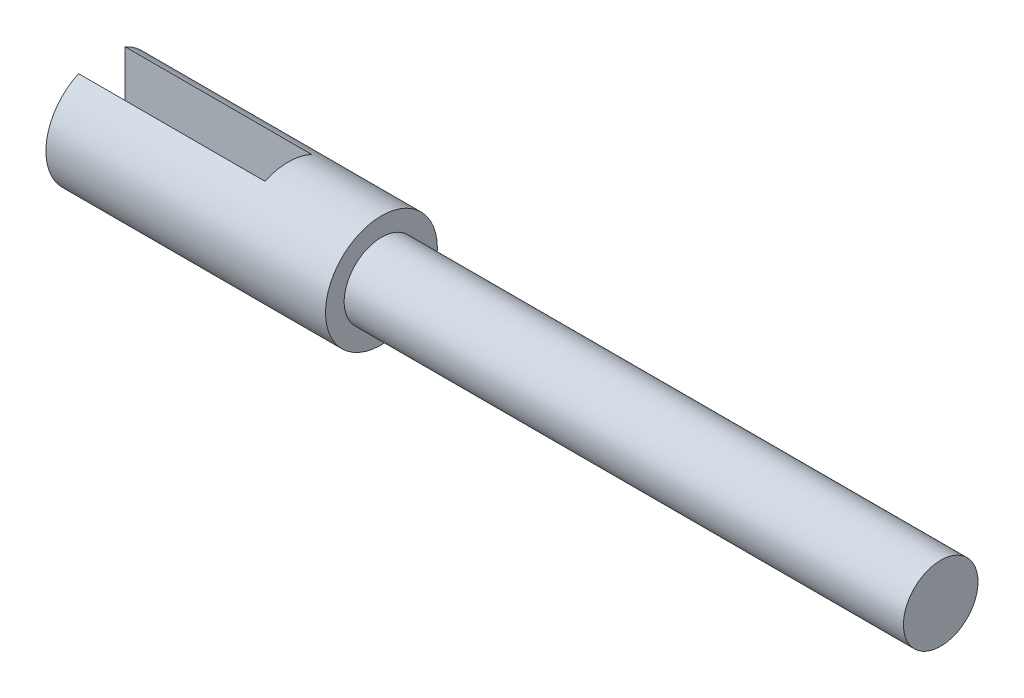
ISO-10303-21;
HEADER;
FILE_DESCRIPTION(('STEP AP214'),'2;1');
FILE_NAME('part.step','',(''),(''),'','','');
FILE_SCHEMA(('AUTOMOTIVE_DESIGN { 1 0 10303 214 1 1 1 1 }'));
ENDSEC;
DATA;
#1=APPLICATION_CONTEXT('core data for automotive mechanical design processes');
#2=APPLICATION_PROTOCOL_DEFINITION('international standard','automotive_design',2000,#1);
#3=PRODUCT_CONTEXT('',#1,'mechanical');
#4=PRODUCT('Part','Part','',(#3));
#5=PRODUCT_RELATED_PRODUCT_CATEGORY('part','',(#4));
#6=PRODUCT_DEFINITION_FORMATION('','',#4);
#7=PRODUCT_DEFINITION_CONTEXT('part definition',#1,'design');
#8=PRODUCT_DEFINITION('design','',#6,#7);
#9=PRODUCT_DEFINITION_SHAPE('','',#8);
#10=(LENGTH_UNIT() NAMED_UNIT(*) SI_UNIT(.MILLI.,.METRE.));
#11=(NAMED_UNIT(*) PLANE_ANGLE_UNIT() SI_UNIT($,.RADIAN.));
#12=(NAMED_UNIT(*) SI_UNIT($,.STERADIAN.) SOLID_ANGLE_UNIT());
#13=UNCERTAINTY_MEASURE_WITH_UNIT(LENGTH_MEASURE(1.E-05),#10,'distance_accuracy_value','');
#14=(GEOMETRIC_REPRESENTATION_CONTEXT(3) GLOBAL_UNCERTAINTY_ASSIGNED_CONTEXT((#13)) GLOBAL_UNIT_ASSIGNED_CONTEXT((#10,
#11,#12)) REPRESENTATION_CONTEXT('',''));
#15=CARTESIAN_POINT('',(0.,0.,0.));
#16=DIRECTION('',(0.,0.,1.));
#17=DIRECTION('',(1.,0.,0.));
#18=AXIS2_PLACEMENT_3D('',#15,#16,#17);
#19=CARTESIAN_POINT('',(-19.05,0.,0.));
#20=DIRECTION('',(1.,0.,0.));
#21=DIRECTION('',(0.,0.,-1.));
#22=AXIS2_PLACEMENT_3D('',#19,#20,#21);
#23=PLANE('',#22);
#24=CARTESIAN_POINT('',(-19.05,0.,0.));
#25=DIRECTION('',(1.,0.,0.));
#26=DIRECTION('',(0.,0.,-1.));
#27=AXIS2_PLACEMENT_3D('',#24,#25,#26);
#28=CIRCLE('',#27,3.81);
#29=CARTESIAN_POINT('',(-19.05,-3.46351609639684,-1.5875));
#30=VERTEX_POINT('',#29);
#31=CARTESIAN_POINT('',(-19.05,3.46351609639684,-1.5875));
#32=VERTEX_POINT('',#31);
#33=EDGE_CURVE('E94',#30,#32,#28,.T.);
#34=ORIENTED_EDGE('',*,*,#33,.F.);
#35=DIRECTION('',(0.,1.,0.));
#36=VECTOR('',#35,1.);
#37=CARTESIAN_POINT('',(-19.05,0.,-1.5875));
#38=LINE('',#37,#36);
#39=EDGE_CURVE('E106',#30,#32,#38,.T.);
#40=ORIENTED_EDGE('',*,*,#39,.T.);
#41=EDGE_LOOP('',(#34,#40));
#42=FACE_BOUND('',#41,.T.);
#43=ADVANCED_FACE('F32',(#42),#23,.F.);
#44=CARTESIAN_POINT('',(38.1,0.,0.));
#45=DIRECTION('',(-1.,0.,0.));
#46=DIRECTION('',(0.,0.,1.));
#47=AXIS2_PLACEMENT_3D('',#44,#45,#46);
#48=CYLINDRICAL_SURFACE('',#47,2.54);
#49=CARTESIAN_POINT('',(38.1,0.,0.));
#50=DIRECTION('',(1.,0.,0.));
#51=DIRECTION('',(0.,0.,-1.));
#52=AXIS2_PLACEMENT_3D('',#49,#50,#51);
#53=CIRCLE('',#52,2.54);
#54=CARTESIAN_POINT('',(38.1,0.,-2.54));
#55=VERTEX_POINT('',#54);
#56=EDGE_CURVE('E102',#55,#55,#53,.T.);
#57=ORIENTED_EDGE('',*,*,#56,.F.);
#58=EDGE_LOOP('',(#57));
#59=FACE_BOUND('',#58,.T.);
#60=CARTESIAN_POINT('',(0.,0.,0.));
#61=DIRECTION('',(1.,0.,0.));
#62=DIRECTION('',(0.,0.,-1.));
#63=AXIS2_PLACEMENT_3D('',#60,#61,#62);
#64=CIRCLE('',#63,2.54);
#65=CARTESIAN_POINT('',(0.,0.,-2.54));
#66=VERTEX_POINT('',#65);
#67=EDGE_CURVE('E99',#66,#66,#64,.T.);
#68=ORIENTED_EDGE('',*,*,#67,.T.);
#69=EDGE_LOOP('',(#68));
#70=FACE_BOUND('',#69,.T.);
#71=ADVANCED_FACE('F34',(#59,#70),#48,.T.);
#72=CARTESIAN_POINT('',(38.1,0.,0.));
#73=DIRECTION('',(1.,0.,0.));
#74=DIRECTION('',(0.,0.,-1.));
#75=AXIS2_PLACEMENT_3D('',#72,#73,#74);
#76=PLANE('',#75);
#77=ORIENTED_EDGE('',*,*,#56,.T.);
#78=EDGE_LOOP('',(#77));
#79=FACE_BOUND('',#78,.T.);
#80=ADVANCED_FACE('F130',(#79),#76,.T.);
#81=CARTESIAN_POINT('',(-19.05,0.,0.));
#82=DIRECTION('',(1.,0.,0.));
#83=DIRECTION('',(0.,0.,-1.));
#84=AXIS2_PLACEMENT_3D('',#81,#82,#83);
#85=CYLINDRICAL_SURFACE('',#84,3.81);
#86=DIRECTION('',(1.,0.,0.));
#87=VECTOR('',#86,1.);
#88=CARTESIAN_POINT('',(-19.05,-3.46351609639684,-1.5875));
#89=LINE('',#88,#87);
#90=CARTESIAN_POINT('',(-6.35,-3.46351609639684,-1.5875));
#91=VERTEX_POINT('',#90);
#92=EDGE_CURVE('E86',#30,#91,#89,.T.);
#93=ORIENTED_EDGE('',*,*,#92,.F.);
#94=ORIENTED_EDGE('',*,*,#33,.T.);
#95=DIRECTION('',(1.,0.,0.));
#96=VECTOR('',#95,1.);
#97=CARTESIAN_POINT('',(-19.05,3.46351609639684,-1.5875));
#98=LINE('',#97,#96);
#99=CARTESIAN_POINT('',(-6.35,3.46351609639684,-1.5875));
#100=VERTEX_POINT('',#99);
#101=EDGE_CURVE('E88',#100,#32,#98,.F.);
#102=ORIENTED_EDGE('',*,*,#101,.F.);
#103=CARTESIAN_POINT('',(-6.35,0.,0.));
#104=DIRECTION('',(1.,0.,0.));
#105=DIRECTION('',(0.,0.,-1.));
#106=AXIS2_PLACEMENT_3D('',#103,#104,#105);
#107=CIRCLE('',#106,3.81);
#108=CARTESIAN_POINT('',(-6.35,3.46351609639684,1.5875));
#109=VERTEX_POINT('',#108);
#110=EDGE_CURVE('E36',#109,#100,#107,.F.);
#111=ORIENTED_EDGE('',*,*,#110,.F.);
#112=DIRECTION('',(1.,0.,0.));
#113=VECTOR('',#112,1.);
#114=CARTESIAN_POINT('',(-19.05,3.46351609639684,1.5875));
#115=LINE('',#114,#113);
#116=CARTESIAN_POINT('',(-19.05,3.46351609639684,1.5875));
#117=VERTEX_POINT('',#116);
#118=EDGE_CURVE('E79',#117,#109,#115,.T.);
#119=ORIENTED_EDGE('',*,*,#118,.F.);
#120=CARTESIAN_POINT('',(-19.05,-3.46351609639684,1.5875));
#121=VERTEX_POINT('',#120);
#122=EDGE_CURVE('E85',#117,#121,#28,.T.);
#123=ORIENTED_EDGE('',*,*,#122,.T.);
#124=DIRECTION('',(1.,0.,0.));
#125=VECTOR('',#124,1.);
#126=CARTESIAN_POINT('',(-19.05,-3.46351609639684,1.5875));
#127=LINE('',#126,#125);
#128=CARTESIAN_POINT('',(-6.35,-3.46351609639684,1.5875));
#129=VERTEX_POINT('',#128);
#130=EDGE_CURVE('E47',#129,#121,#127,.F.);
#131=ORIENTED_EDGE('',*,*,#130,.F.);
#132=EDGE_CURVE('E11',#91,#129,#107,.F.);
#133=ORIENTED_EDGE('',*,*,#132,.F.);
#134=EDGE_LOOP('',(#93,#94,#102,#111,#119,#123,#131,#133));
#135=FACE_BOUND('',#134,.T.);
#136=CARTESIAN_POINT('',(0.,0.,0.));
#137=DIRECTION('',(1.,0.,0.));
#138=DIRECTION('',(0.,0.,-1.));
#139=AXIS2_PLACEMENT_3D('',#136,#137,#138);
#140=CIRCLE('',#139,3.81);
#141=CARTESIAN_POINT('',(0.,0.,-3.81));
#142=VERTEX_POINT('',#141);
#143=EDGE_CURVE('E93',#142,#142,#140,.T.);
#144=ORIENTED_EDGE('',*,*,#143,.F.);
#145=EDGE_LOOP('',(#144));
#146=FACE_BOUND('',#145,.T.);
#147=ADVANCED_FACE('F82',(#135,#146),#85,.T.);
#148=ORIENTED_EDGE('',*,*,#122,.F.);
#149=DIRECTION('',(0.,-1.,0.));
#150=VECTOR('',#149,1.);
#151=CARTESIAN_POINT('',(-19.05,0.,1.5875));
#152=LINE('',#151,#150);
#153=EDGE_CURVE('E105',#117,#121,#152,.T.);
#154=ORIENTED_EDGE('',*,*,#153,.T.);
#155=EDGE_LOOP('',(#148,#154));
#156=FACE_BOUND('',#155,.T.);
#157=ADVANCED_FACE('F122',(#156),#23,.F.);
#158=CARTESIAN_POINT('',(0.,0.,0.));
#159=DIRECTION('',(1.,0.,0.));
#160=DIRECTION('',(0.,0.,-1.));
#161=AXIS2_PLACEMENT_3D('',#158,#159,#160);
#162=PLANE('',#161);
#163=ORIENTED_EDGE('',*,*,#67,.F.);
#164=EDGE_LOOP('',(#163));
#165=FACE_BOUND('',#164,.T.);
#166=ORIENTED_EDGE('',*,*,#143,.T.);
#167=EDGE_LOOP('',(#166));
#168=FACE_BOUND('',#167,.T.);
#169=ADVANCED_FACE('F115',(#165,#168),#162,.T.);
#170=CARTESIAN_POINT('',(-19.05,-3.81,-1.5875));
#171=DIRECTION('',(0.,0.,-1.));
#172=DIRECTION('',(-1.,0.,0.));
#173=AXIS2_PLACEMENT_3D('',#170,#171,#172);
#174=PLANE('',#173);
#175=ORIENTED_EDGE('',*,*,#101,.T.);
#176=ORIENTED_EDGE('',*,*,#39,.F.);
#177=ORIENTED_EDGE('',*,*,#92,.T.);
#178=DIRECTION('',(0.,1.,0.));
#179=VECTOR('',#178,1.);
#180=CARTESIAN_POINT('',(-6.35,-3.81,-1.5875));
#181=LINE('',#180,#179);
#182=EDGE_CURVE('E72',#91,#100,#181,.T.);
#183=ORIENTED_EDGE('',*,*,#182,.T.);
#184=EDGE_LOOP('',(#175,#176,#177,#183));
#185=FACE_BOUND('',#184,.T.);
#186=ADVANCED_FACE('F112',(#185),#174,.F.);
#187=CARTESIAN_POINT('',(-6.35,-3.81,-1.5875));
#188=DIRECTION('',(1.,0.,0.));
#189=DIRECTION('',(0.,0.,-1.));
#190=AXIS2_PLACEMENT_3D('',#187,#188,#189);
#191=PLANE('',#190);
#192=ORIENTED_EDGE('',*,*,#182,.F.);
#193=ORIENTED_EDGE('',*,*,#132,.T.);
#194=DIRECTION('',(0.,1.,0.));
#195=VECTOR('',#194,1.);
#196=CARTESIAN_POINT('',(-6.35,-3.81,1.5875));
#197=LINE('',#196,#195);
#198=EDGE_CURVE('E71',#129,#109,#197,.T.);
#199=ORIENTED_EDGE('',*,*,#198,.T.);
#200=ORIENTED_EDGE('',*,*,#110,.T.);
#201=EDGE_LOOP('',(#192,#193,#199,#200));
#202=FACE_BOUND('',#201,.T.);
#203=ADVANCED_FACE('F70',(#202),#191,.F.);
#204=CARTESIAN_POINT('',(-19.05,-3.81,1.5875));
#205=DIRECTION('',(0.,0.,1.));
#206=DIRECTION('',(1.,0.,0.));
#207=AXIS2_PLACEMENT_3D('',#204,#205,#206);
#208=PLANE('',#207);
#209=ORIENTED_EDGE('',*,*,#130,.T.);
#210=ORIENTED_EDGE('',*,*,#153,.F.);
#211=ORIENTED_EDGE('',*,*,#118,.T.);
#212=ORIENTED_EDGE('',*,*,#198,.F.);
#213=EDGE_LOOP('',(#209,#210,#211,#212));
#214=FACE_BOUND('',#213,.T.);
#215=ADVANCED_FACE('F77',(#214),#208,.F.);
#216=CLOSED_SHELL('',(#43,#71,#80,#147,#157,#169,#186,#203,#215));
#217=MANIFOLD_SOLID_BREP('B2',#216);
#218=ADVANCED_BREP_SHAPE_REPRESENTATION('',(#18,#217),#14);
#219=SHAPE_DEFINITION_REPRESENTATION(#9,#218);
ENDSEC;
END-ISO-10303-21;
